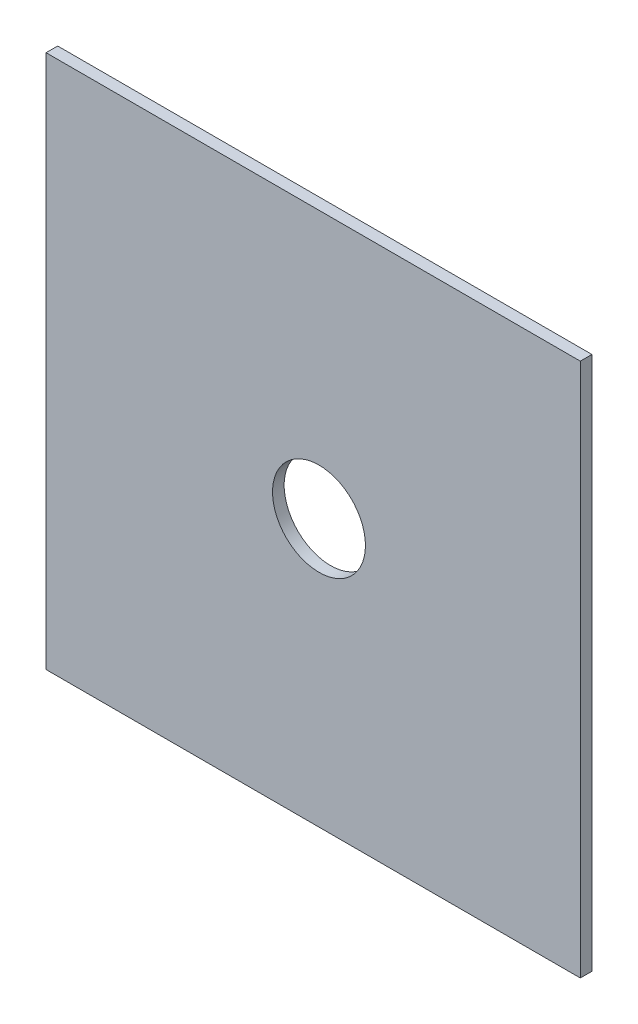
ISO-10303-21;
HEADER;
FILE_DESCRIPTION(('STEP AP214'),'2;1');
FILE_NAME('part.step','',(''),(''),'','','');
FILE_SCHEMA(('AUTOMOTIVE_DESIGN { 1 0 10303 214 1 1 1 1 }'));
ENDSEC;
DATA;
#1=APPLICATION_CONTEXT('core data for automotive mechanical design processes');
#2=APPLICATION_PROTOCOL_DEFINITION('international standard','automotive_design',2000,#1);
#3=PRODUCT_CONTEXT('',#1,'mechanical');
#4=PRODUCT('Part','Part','',(#3));
#5=PRODUCT_RELATED_PRODUCT_CATEGORY('part','',(#4));
#6=PRODUCT_DEFINITION_FORMATION('','',#4);
#7=PRODUCT_DEFINITION_CONTEXT('part definition',#1,'design');
#8=PRODUCT_DEFINITION('design','',#6,#7);
#9=PRODUCT_DEFINITION_SHAPE('','',#8);
#10=(LENGTH_UNIT() NAMED_UNIT(*) SI_UNIT(.MILLI.,.METRE.));
#11=(NAMED_UNIT(*) PLANE_ANGLE_UNIT() SI_UNIT($,.RADIAN.));
#12=(NAMED_UNIT(*) SI_UNIT($,.STERADIAN.) SOLID_ANGLE_UNIT());
#13=UNCERTAINTY_MEASURE_WITH_UNIT(LENGTH_MEASURE(1.E-05),#10,'distance_accuracy_value','');
#14=(GEOMETRIC_REPRESENTATION_CONTEXT(3) GLOBAL_UNCERTAINTY_ASSIGNED_CONTEXT((#13)) GLOBAL_UNIT_ASSIGNED_CONTEXT((#10,
#11,#12)) REPRESENTATION_CONTEXT('',''));
#15=CARTESIAN_POINT('',(0.,0.,0.));
#16=DIRECTION('',(0.,0.,1.));
#17=DIRECTION('',(1.,0.,0.));
#18=AXIS2_PLACEMENT_3D('',#15,#16,#17);
#19=CARTESIAN_POINT('',(-74.6125,142.875,3.175));
#20=DIRECTION('',(1.,0.,0.));
#21=DIRECTION('',(0.,0.,-1.));
#22=AXIS2_PLACEMENT_3D('',#19,#20,#21);
#23=PLANE('',#22);
#24=DIRECTION('',(0.,-1.,0.));
#25=VECTOR('',#24,1.);
#26=CARTESIAN_POINT('',(-74.6125,142.875,0.));
#27=LINE('',#26,#25);
#28=CARTESIAN_POINT('',(-74.6125,142.875,0.));
#29=VERTEX_POINT('',#28);
#30=CARTESIAN_POINT('',(-74.6125,-3.175,0.));
#31=VERTEX_POINT('',#30);
#32=EDGE_CURVE('E96',#29,#31,#27,.T.);
#33=ORIENTED_EDGE('',*,*,#32,.T.);
#34=DIRECTION('',(0.,0.,-1.));
#35=VECTOR('',#34,1.);
#36=CARTESIAN_POINT('',(-74.6125,-3.175,3.175));
#37=LINE('',#36,#35);
#38=CARTESIAN_POINT('',(-74.6125,-3.175,3.175));
#39=VERTEX_POINT('',#38);
#40=EDGE_CURVE('E11',#39,#31,#37,.T.);
#41=ORIENTED_EDGE('',*,*,#40,.F.);
#42=DIRECTION('',(0.,-1.,0.));
#43=VECTOR('',#42,1.);
#44=CARTESIAN_POINT('',(-74.6125,142.875,3.175));
#45=LINE('',#44,#43);
#46=CARTESIAN_POINT('',(-74.6125,142.875,3.175));
#47=VERTEX_POINT('',#46);
#48=EDGE_CURVE('E84',#47,#39,#45,.T.);
#49=ORIENTED_EDGE('',*,*,#48,.F.);
#50=DIRECTION('',(0.,0.,-1.));
#51=VECTOR('',#50,1.);
#52=CARTESIAN_POINT('',(-74.6125,142.875,3.175));
#53=LINE('',#52,#51);
#54=EDGE_CURVE('E92',#47,#29,#53,.T.);
#55=ORIENTED_EDGE('',*,*,#54,.T.);
#56=EDGE_LOOP('',(#33,#41,#49,#55));
#57=FACE_BOUND('',#56,.T.);
#58=ADVANCED_FACE('F33',(#57),#23,.F.);
#59=CARTESIAN_POINT('',(-74.6125,-3.175,3.175));
#60=DIRECTION('',(0.,1.,0.));
#61=DIRECTION('',(0.,0.,1.));
#62=AXIS2_PLACEMENT_3D('',#59,#60,#61);
#63=PLANE('',#62);
#64=DIRECTION('',(1.,0.,0.));
#65=VECTOR('',#64,1.);
#66=CARTESIAN_POINT('',(-74.6125,-3.175,0.));
#67=LINE('',#66,#65);
#68=CARTESIAN_POINT('',(71.4375,-3.175,0.));
#69=VERTEX_POINT('',#68);
#70=EDGE_CURVE('E88',#31,#69,#67,.T.);
#71=ORIENTED_EDGE('',*,*,#70,.T.);
#72=DIRECTION('',(0.,0.,-1.));
#73=VECTOR('',#72,1.);
#74=CARTESIAN_POINT('',(71.4375,-3.175,3.175));
#75=LINE('',#74,#73);
#76=CARTESIAN_POINT('',(71.4375,-3.175,3.175));
#77=VERTEX_POINT('',#76);
#78=EDGE_CURVE('E41',#77,#69,#75,.T.);
#79=ORIENTED_EDGE('',*,*,#78,.F.);
#80=DIRECTION('',(1.,0.,0.));
#81=VECTOR('',#80,1.);
#82=CARTESIAN_POINT('',(-74.6125,-3.175,3.175));
#83=LINE('',#82,#81);
#84=EDGE_CURVE('E79',#39,#77,#83,.T.);
#85=ORIENTED_EDGE('',*,*,#84,.F.);
#86=ORIENTED_EDGE('',*,*,#40,.T.);
#87=EDGE_LOOP('',(#71,#79,#85,#86));
#88=FACE_BOUND('',#87,.T.);
#89=ADVANCED_FACE('F87',(#88),#63,.F.);
#90=CARTESIAN_POINT('',(71.4375,142.875,3.175));
#91=DIRECTION('',(-1.,0.,0.));
#92=DIRECTION('',(0.,0.,1.));
#93=AXIS2_PLACEMENT_3D('',#90,#91,#92);
#94=PLANE('',#93);
#95=DIRECTION('',(0.,1.,0.));
#96=VECTOR('',#95,1.);
#97=CARTESIAN_POINT('',(71.4375,142.875,0.));
#98=LINE('',#97,#96);
#99=CARTESIAN_POINT('',(71.4375,142.875,0.));
#100=VERTEX_POINT('',#99);
#101=EDGE_CURVE('E66',#69,#100,#98,.T.);
#102=ORIENTED_EDGE('',*,*,#101,.T.);
#103=DIRECTION('',(0.,0.,-1.));
#104=VECTOR('',#103,1.);
#105=CARTESIAN_POINT('',(71.4375,142.875,3.175));
#106=LINE('',#105,#104);
#107=CARTESIAN_POINT('',(71.4375,142.875,3.175));
#108=VERTEX_POINT('',#107);
#109=EDGE_CURVE('E89',#108,#100,#106,.T.);
#110=ORIENTED_EDGE('',*,*,#109,.F.);
#111=DIRECTION('',(0.,1.,0.));
#112=VECTOR('',#111,1.);
#113=CARTESIAN_POINT('',(71.4375,142.875,3.175));
#114=LINE('',#113,#112);
#115=EDGE_CURVE('E82',#77,#108,#114,.T.);
#116=ORIENTED_EDGE('',*,*,#115,.F.);
#117=ORIENTED_EDGE('',*,*,#78,.T.);
#118=EDGE_LOOP('',(#102,#110,#116,#117));
#119=FACE_BOUND('',#118,.T.);
#120=ADVANCED_FACE('F90',(#119),#94,.F.);
#121=CARTESIAN_POINT('',(-74.6125,142.875,3.175));
#122=DIRECTION('',(0.,-1.,0.));
#123=DIRECTION('',(0.,0.,-1.));
#124=AXIS2_PLACEMENT_3D('',#121,#122,#123);
#125=PLANE('',#124);
#126=DIRECTION('',(-1.,0.,0.));
#127=VECTOR('',#126,1.);
#128=CARTESIAN_POINT('',(-74.6125,142.875,0.));
#129=LINE('',#128,#127);
#130=EDGE_CURVE('E72',#100,#29,#129,.T.);
#131=ORIENTED_EDGE('',*,*,#130,.T.);
#132=ORIENTED_EDGE('',*,*,#54,.F.);
#133=DIRECTION('',(-1.,0.,0.));
#134=VECTOR('',#133,1.);
#135=CARTESIAN_POINT('',(-74.6125,142.875,3.175));
#136=LINE('',#135,#134);
#137=EDGE_CURVE('E49',#108,#47,#136,.T.);
#138=ORIENTED_EDGE('',*,*,#137,.F.);
#139=ORIENTED_EDGE('',*,*,#109,.T.);
#140=EDGE_LOOP('',(#131,#132,#138,#139));
#141=FACE_BOUND('',#140,.T.);
#142=ADVANCED_FACE('F104',(#141),#125,.F.);
#143=CARTESIAN_POINT('',(0.,0.,3.175));
#144=DIRECTION('',(0.,0.,1.));
#145=DIRECTION('',(1.,0.,0.));
#146=AXIS2_PLACEMENT_3D('',#143,#144,#145);
#147=PLANE('',#146);
#148=CARTESIAN_POINT('',(0.,69.85,3.175));
#149=DIRECTION('',(0.,0.,1.));
#150=DIRECTION('',(1.,0.,0.));
#151=AXIS2_PLACEMENT_3D('',#148,#149,#150);
#152=CIRCLE('',#151,12.7);
#153=CARTESIAN_POINT('',(12.7,69.85,3.175));
#154=VERTEX_POINT('',#153);
#155=EDGE_CURVE('E110',#154,#154,#152,.T.);
#156=ORIENTED_EDGE('',*,*,#155,.F.);
#157=EDGE_LOOP('',(#156));
#158=FACE_BOUND('',#157,.T.);
#159=ORIENTED_EDGE('',*,*,#48,.T.);
#160=ORIENTED_EDGE('',*,*,#84,.T.);
#161=ORIENTED_EDGE('',*,*,#115,.T.);
#162=ORIENTED_EDGE('',*,*,#137,.T.);
#163=EDGE_LOOP('',(#159,#160,#161,#162));
#164=FACE_BOUND('',#163,.T.);
#165=ADVANCED_FACE('F80',(#158,#164),#147,.T.);
#166=CARTESIAN_POINT('',(0.,0.,0.));
#167=DIRECTION('',(0.,0.,1.));
#168=DIRECTION('',(1.,0.,0.));
#169=AXIS2_PLACEMENT_3D('',#166,#167,#168);
#170=PLANE('',#169);
#171=CARTESIAN_POINT('',(0.,69.85,0.));
#172=DIRECTION('',(0.,0.,1.));
#173=DIRECTION('',(1.,0.,0.));
#174=AXIS2_PLACEMENT_3D('',#171,#172,#173);
#175=CIRCLE('',#174,12.7);
#176=CARTESIAN_POINT('',(12.7,69.85,0.));
#177=VERTEX_POINT('',#176);
#178=EDGE_CURVE('E99',#177,#177,#175,.T.);
#179=ORIENTED_EDGE('',*,*,#178,.T.);
#180=EDGE_LOOP('',(#179));
#181=FACE_BOUND('',#180,.T.);
#182=ORIENTED_EDGE('',*,*,#32,.F.);
#183=ORIENTED_EDGE('',*,*,#130,.F.);
#184=ORIENTED_EDGE('',*,*,#101,.F.);
#185=ORIENTED_EDGE('',*,*,#70,.F.);
#186=EDGE_LOOP('',(#182,#183,#184,#185));
#187=FACE_BOUND('',#186,.T.);
#188=ADVANCED_FACE('F107',(#181,#187),#170,.F.);
#189=CARTESIAN_POINT('',(0.,69.85,0.));
#190=DIRECTION('',(0.,0.,1.));
#191=DIRECTION('',(1.,0.,0.));
#192=AXIS2_PLACEMENT_3D('',#189,#190,#191);
#193=CYLINDRICAL_SURFACE('',#192,12.7);
#194=ORIENTED_EDGE('',*,*,#178,.F.);
#195=EDGE_LOOP('',(#194));
#196=FACE_BOUND('',#195,.T.);
#197=ORIENTED_EDGE('',*,*,#155,.T.);
#198=EDGE_LOOP('',(#197));
#199=FACE_BOUND('',#198,.T.);
#200=ADVANCED_FACE('F117',(#196,#199),#193,.F.);
#201=CLOSED_SHELL('',(#58,#89,#120,#142,#165,#188,#200));
#202=MANIFOLD_SOLID_BREP('B2',#201);
#203=ADVANCED_BREP_SHAPE_REPRESENTATION('',(#18,#202),#14);
#204=SHAPE_DEFINITION_REPRESENTATION(#9,#203);
ENDSEC;
END-ISO-10303-21;
